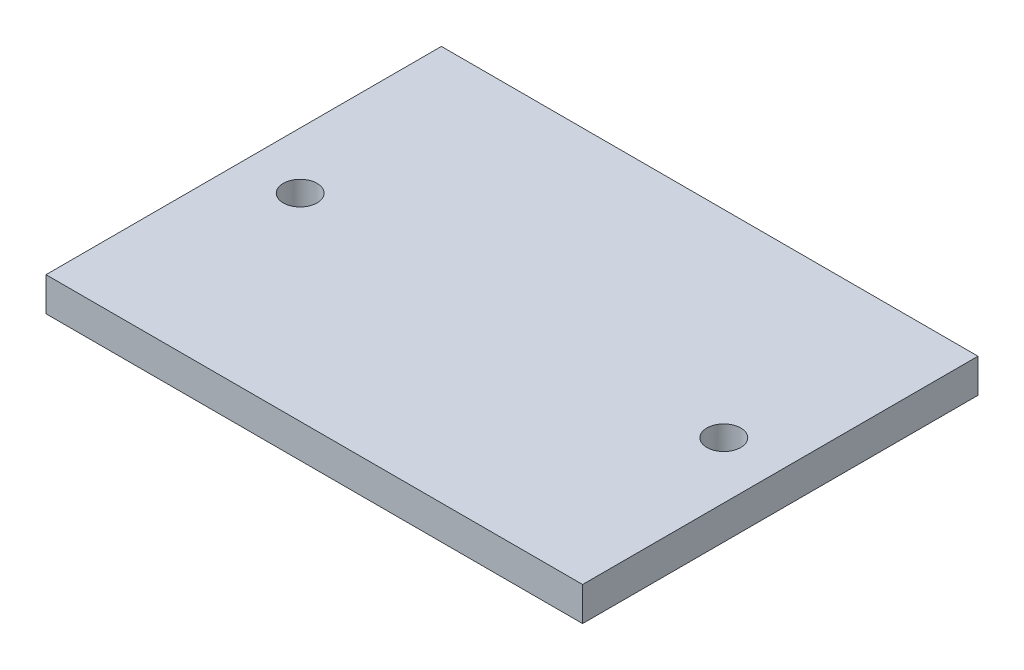
ISO-10303-21;
HEADER;
FILE_DESCRIPTION(('STEP AP214'),'2;1');
FILE_NAME('part.step','',(''),(''),'','','');
FILE_SCHEMA(('AUTOMOTIVE_DESIGN { 1 0 10303 214 1 1 1 1 }'));
ENDSEC;
DATA;
#1=APPLICATION_CONTEXT('core data for automotive mechanical design processes');
#2=APPLICATION_PROTOCOL_DEFINITION('international standard','automotive_design',2000,#1);
#3=PRODUCT_CONTEXT('',#1,'mechanical');
#4=PRODUCT('Part','Part','',(#3));
#5=PRODUCT_RELATED_PRODUCT_CATEGORY('part','',(#4));
#6=PRODUCT_DEFINITION_FORMATION('','',#4);
#7=PRODUCT_DEFINITION_CONTEXT('part definition',#1,'design');
#8=PRODUCT_DEFINITION('design','',#6,#7);
#9=PRODUCT_DEFINITION_SHAPE('','',#8);
#10=(LENGTH_UNIT() NAMED_UNIT(*) SI_UNIT(.MILLI.,.METRE.));
#11=(NAMED_UNIT(*) PLANE_ANGLE_UNIT() SI_UNIT($,.RADIAN.));
#12=(NAMED_UNIT(*) SI_UNIT($,.STERADIAN.) SOLID_ANGLE_UNIT());
#13=UNCERTAINTY_MEASURE_WITH_UNIT(LENGTH_MEASURE(1.E-05),#10,'distance_accuracy_value','');
#14=(GEOMETRIC_REPRESENTATION_CONTEXT(3) GLOBAL_UNCERTAINTY_ASSIGNED_CONTEXT((#13)) GLOBAL_UNIT_ASSIGNED_CONTEXT((#10,
#11,#12)) REPRESENTATION_CONTEXT('',''));
#15=CARTESIAN_POINT('',(0.,0.,0.));
#16=DIRECTION('',(0.,0.,1.));
#17=DIRECTION('',(1.,0.,0.));
#18=AXIS2_PLACEMENT_3D('',#15,#16,#17);
#19=CARTESIAN_POINT('',(0.,3.,0.));
#20=DIRECTION('',(0.,-1.,0.));
#21=DIRECTION('',(0.,0.,-1.));
#22=AXIS2_PLACEMENT_3D('',#19,#20,#21);
#23=PLANE('',#22);
#24=DIRECTION('',(0.,0.,1.));
#25=VECTOR('',#24,1.);
#26=CARTESIAN_POINT('',(0.,3.,0.));
#27=LINE('',#26,#25);
#28=CARTESIAN_POINT('',(0.,3.,-35.));
#29=VERTEX_POINT('',#28);
#30=CARTESIAN_POINT('',(0.,3.,0.));
#31=VERTEX_POINT('',#30);
#32=EDGE_CURVE('E85',#29,#31,#27,.T.);
#33=ORIENTED_EDGE('',*,*,#32,.T.);
#34=DIRECTION('',(1.,0.,0.));
#35=VECTOR('',#34,1.);
#36=CARTESIAN_POINT('',(0.,3.,0.));
#37=LINE('',#36,#35);
#38=CARTESIAN_POINT('',(47.5,3.,0.));
#39=VERTEX_POINT('',#38);
#40=EDGE_CURVE('E80',#31,#39,#37,.T.);
#41=ORIENTED_EDGE('',*,*,#40,.T.);
#42=DIRECTION('',(0.,0.,-1.));
#43=VECTOR('',#42,1.);
#44=CARTESIAN_POINT('',(47.5,3.,0.));
#45=LINE('',#44,#43);
#46=CARTESIAN_POINT('',(47.5,3.,-35.));
#47=VERTEX_POINT('',#46);
#48=EDGE_CURVE('E83',#39,#47,#45,.T.);
#49=ORIENTED_EDGE('',*,*,#48,.T.);
#50=DIRECTION('',(-1.,0.,0.));
#51=VECTOR('',#50,1.);
#52=CARTESIAN_POINT('',(0.,3.,-35.));
#53=LINE('',#52,#51);
#54=EDGE_CURVE('E50',#47,#29,#53,.T.);
#55=ORIENTED_EDGE('',*,*,#54,.T.);
#56=EDGE_LOOP('',(#33,#41,#49,#55));
#57=FACE_BOUND('',#56,.T.);
#58=CARTESIAN_POINT('',(42.5,3.,-17.5));
#59=DIRECTION('',(0.,1.,0.));
#60=DIRECTION('',(0.,0.,1.));
#61=AXIS2_PLACEMENT_3D('',#58,#59,#60);
#62=CIRCLE('',#61,1.49999999999999);
#63=CARTESIAN_POINT('',(42.5,3.,-16.));
#64=VERTEX_POINT('',#63);
#65=EDGE_CURVE('E113',#64,#64,#62,.T.);
#66=ORIENTED_EDGE('',*,*,#65,.F.);
#67=EDGE_LOOP('',(#66));
#68=FACE_BOUND('',#67,.T.);
#69=CARTESIAN_POINT('',(4.99999999999999,3.,-17.5));
#70=DIRECTION('',(0.,1.,0.));
#71=DIRECTION('',(0.,0.,1.));
#72=AXIS2_PLACEMENT_3D('',#69,#70,#71);
#73=CIRCLE('',#72,1.5);
#74=CARTESIAN_POINT('',(4.99999999999999,3.,-16.));
#75=VERTEX_POINT('',#74);
#76=EDGE_CURVE('E119',#75,#75,#73,.T.);
#77=ORIENTED_EDGE('',*,*,#76,.F.);
#78=EDGE_LOOP('',(#77));
#79=FACE_BOUND('',#78,.T.);
#80=ADVANCED_FACE('F33',(#57,#68,#79),#23,.F.);
#81=CARTESIAN_POINT('',(0.,3.,0.));
#82=DIRECTION('',(1.,0.,0.));
#83=DIRECTION('',(0.,0.,-1.));
#84=AXIS2_PLACEMENT_3D('',#81,#82,#83);
#85=PLANE('',#84);
#86=DIRECTION('',(0.,0.,1.));
#87=VECTOR('',#86,1.);
#88=CARTESIAN_POINT('',(0.,0.,0.));
#89=LINE('',#88,#87);
#90=CARTESIAN_POINT('',(0.,0.,-35.));
#91=VERTEX_POINT('',#90);
#92=CARTESIAN_POINT('',(0.,0.,0.));
#93=VERTEX_POINT('',#92);
#94=EDGE_CURVE('E97',#91,#93,#89,.T.);
#95=ORIENTED_EDGE('',*,*,#94,.T.);
#96=DIRECTION('',(0.,-1.,0.));
#97=VECTOR('',#96,1.);
#98=CARTESIAN_POINT('',(0.,3.,0.));
#99=LINE('',#98,#97);
#100=EDGE_CURVE('E11',#31,#93,#99,.T.);
#101=ORIENTED_EDGE('',*,*,#100,.F.);
#102=ORIENTED_EDGE('',*,*,#32,.F.);
#103=DIRECTION('',(0.,-1.,0.));
#104=VECTOR('',#103,1.);
#105=CARTESIAN_POINT('',(0.,3.,-35.));
#106=LINE('',#105,#104);
#107=EDGE_CURVE('E93',#29,#91,#106,.T.);
#108=ORIENTED_EDGE('',*,*,#107,.T.);
#109=EDGE_LOOP('',(#95,#101,#102,#108));
#110=FACE_BOUND('',#109,.T.);
#111=ADVANCED_FACE('F35',(#110),#85,.F.);
#112=CARTESIAN_POINT('',(0.,3.,0.));
#113=DIRECTION('',(0.,0.,-1.));
#114=DIRECTION('',(-1.,0.,0.));
#115=AXIS2_PLACEMENT_3D('',#112,#113,#114);
#116=PLANE('',#115);
#117=DIRECTION('',(1.,0.,0.));
#118=VECTOR('',#117,1.);
#119=CARTESIAN_POINT('',(0.,0.,0.));
#120=LINE('',#119,#118);
#121=CARTESIAN_POINT('',(47.5,0.,0.));
#122=VERTEX_POINT('',#121);
#123=EDGE_CURVE('E89',#93,#122,#120,.T.);
#124=ORIENTED_EDGE('',*,*,#123,.T.);
#125=DIRECTION('',(0.,-1.,0.));
#126=VECTOR('',#125,1.);
#127=CARTESIAN_POINT('',(47.5,3.,0.));
#128=LINE('',#127,#126);
#129=EDGE_CURVE('E42',#39,#122,#128,.T.);
#130=ORIENTED_EDGE('',*,*,#129,.F.);
#131=ORIENTED_EDGE('',*,*,#40,.F.);
#132=ORIENTED_EDGE('',*,*,#100,.T.);
#133=EDGE_LOOP('',(#124,#130,#131,#132));
#134=FACE_BOUND('',#133,.T.);
#135=ADVANCED_FACE('F88',(#134),#116,.F.);
#136=CARTESIAN_POINT('',(47.5,3.,0.));
#137=DIRECTION('',(-1.,0.,0.));
#138=DIRECTION('',(0.,0.,1.));
#139=AXIS2_PLACEMENT_3D('',#136,#137,#138);
#140=PLANE('',#139);
#141=DIRECTION('',(0.,0.,-1.));
#142=VECTOR('',#141,1.);
#143=CARTESIAN_POINT('',(47.5,0.,0.));
#144=LINE('',#143,#142);
#145=CARTESIAN_POINT('',(47.5,0.,-35.));
#146=VERTEX_POINT('',#145);
#147=EDGE_CURVE('E67',#122,#146,#144,.T.);
#148=ORIENTED_EDGE('',*,*,#147,.T.);
#149=DIRECTION('',(0.,-1.,0.));
#150=VECTOR('',#149,1.);
#151=CARTESIAN_POINT('',(47.5,3.,-35.));
#152=LINE('',#151,#150);
#153=EDGE_CURVE('E90',#47,#146,#152,.T.);
#154=ORIENTED_EDGE('',*,*,#153,.F.);
#155=ORIENTED_EDGE('',*,*,#48,.F.);
#156=ORIENTED_EDGE('',*,*,#129,.T.);
#157=EDGE_LOOP('',(#148,#154,#155,#156));
#158=FACE_BOUND('',#157,.T.);
#159=ADVANCED_FACE('F91',(#158),#140,.F.);
#160=CARTESIAN_POINT('',(0.,3.,-35.));
#161=DIRECTION('',(0.,0.,1.));
#162=DIRECTION('',(1.,0.,0.));
#163=AXIS2_PLACEMENT_3D('',#160,#161,#162);
#164=PLANE('',#163);
#165=DIRECTION('',(-1.,0.,0.));
#166=VECTOR('',#165,1.);
#167=CARTESIAN_POINT('',(0.,0.,-35.));
#168=LINE('',#167,#166);
#169=EDGE_CURVE('E73',#146,#91,#168,.T.);
#170=ORIENTED_EDGE('',*,*,#169,.T.);
#171=ORIENTED_EDGE('',*,*,#107,.F.);
#172=ORIENTED_EDGE('',*,*,#54,.F.);
#173=ORIENTED_EDGE('',*,*,#153,.T.);
#174=EDGE_LOOP('',(#170,#171,#172,#173));
#175=FACE_BOUND('',#174,.T.);
#176=ADVANCED_FACE('F105',(#175),#164,.F.);
#177=CARTESIAN_POINT('',(0.,0.,0.));
#178=DIRECTION('',(0.,-1.,0.));
#179=DIRECTION('',(0.,0.,-1.));
#180=AXIS2_PLACEMENT_3D('',#177,#178,#179);
#181=PLANE('',#180);
#182=CARTESIAN_POINT('',(4.99999999999999,0.,-17.5));
#183=DIRECTION('',(0.,-1.,0.));
#184=DIRECTION('',(0.,0.,-1.));
#185=AXIS2_PLACEMENT_3D('',#182,#183,#184);
#186=CIRCLE('',#185,1.5);
#187=CARTESIAN_POINT('',(4.99999999999999,0.,-19.));
#188=VERTEX_POINT('',#187);
#189=EDGE_CURVE('E116',#188,#188,#186,.T.);
#190=ORIENTED_EDGE('',*,*,#189,.F.);
#191=EDGE_LOOP('',(#190));
#192=FACE_BOUND('',#191,.T.);
#193=CARTESIAN_POINT('',(42.5,0.,-17.5));
#194=DIRECTION('',(0.,-1.,0.));
#195=DIRECTION('',(0.,0.,-1.));
#196=AXIS2_PLACEMENT_3D('',#193,#194,#195);
#197=CIRCLE('',#196,1.5);
#198=CARTESIAN_POINT('',(42.5,0.,-19.));
#199=VERTEX_POINT('',#198);
#200=EDGE_CURVE('E100',#199,#199,#197,.T.);
#201=ORIENTED_EDGE('',*,*,#200,.F.);
#202=EDGE_LOOP('',(#201));
#203=FACE_BOUND('',#202,.T.);
#204=ORIENTED_EDGE('',*,*,#94,.F.);
#205=ORIENTED_EDGE('',*,*,#169,.F.);
#206=ORIENTED_EDGE('',*,*,#147,.F.);
#207=ORIENTED_EDGE('',*,*,#123,.F.);
#208=EDGE_LOOP('',(#204,#205,#206,#207));
#209=FACE_BOUND('',#208,.T.);
#210=ADVANCED_FACE('F108',(#192,#203,#209),#181,.T.);
#211=CARTESIAN_POINT('',(42.5,3.,-17.5));
#212=DIRECTION('',(0.,1.,0.));
#213=DIRECTION('',(0.,0.,1.));
#214=AXIS2_PLACEMENT_3D('',#211,#212,#213);
#215=CYLINDRICAL_SURFACE('',#214,1.5);
#216=ORIENTED_EDGE('',*,*,#65,.T.);
#217=EDGE_LOOP('',(#216));
#218=FACE_BOUND('',#217,.T.);
#219=ORIENTED_EDGE('',*,*,#200,.T.);
#220=EDGE_LOOP('',(#219));
#221=FACE_BOUND('',#220,.T.);
#222=ADVANCED_FACE('F133',(#218,#221),#215,.F.);
#223=CARTESIAN_POINT('',(4.99999999999999,3.,-17.5));
#224=DIRECTION('',(0.,1.,0.));
#225=DIRECTION('',(0.,0.,1.));
#226=AXIS2_PLACEMENT_3D('',#223,#224,#225);
#227=CYLINDRICAL_SURFACE('',#226,1.5);
#228=ORIENTED_EDGE('',*,*,#76,.T.);
#229=EDGE_LOOP('',(#228));
#230=FACE_BOUND('',#229,.T.);
#231=ORIENTED_EDGE('',*,*,#189,.T.);
#232=EDGE_LOOP('',(#231));
#233=FACE_BOUND('',#232,.T.);
#234=ADVANCED_FACE('F123',(#230,#233),#227,.F.);
#235=CLOSED_SHELL('',(#80,#111,#135,#159,#176,#210,#222,#234));
#236=MANIFOLD_SOLID_BREP('B2',#235);
#237=ADVANCED_BREP_SHAPE_REPRESENTATION('',(#18,#236),#14);
#238=SHAPE_DEFINITION_REPRESENTATION(#9,#237);
ENDSEC;
END-ISO-10303-21;
